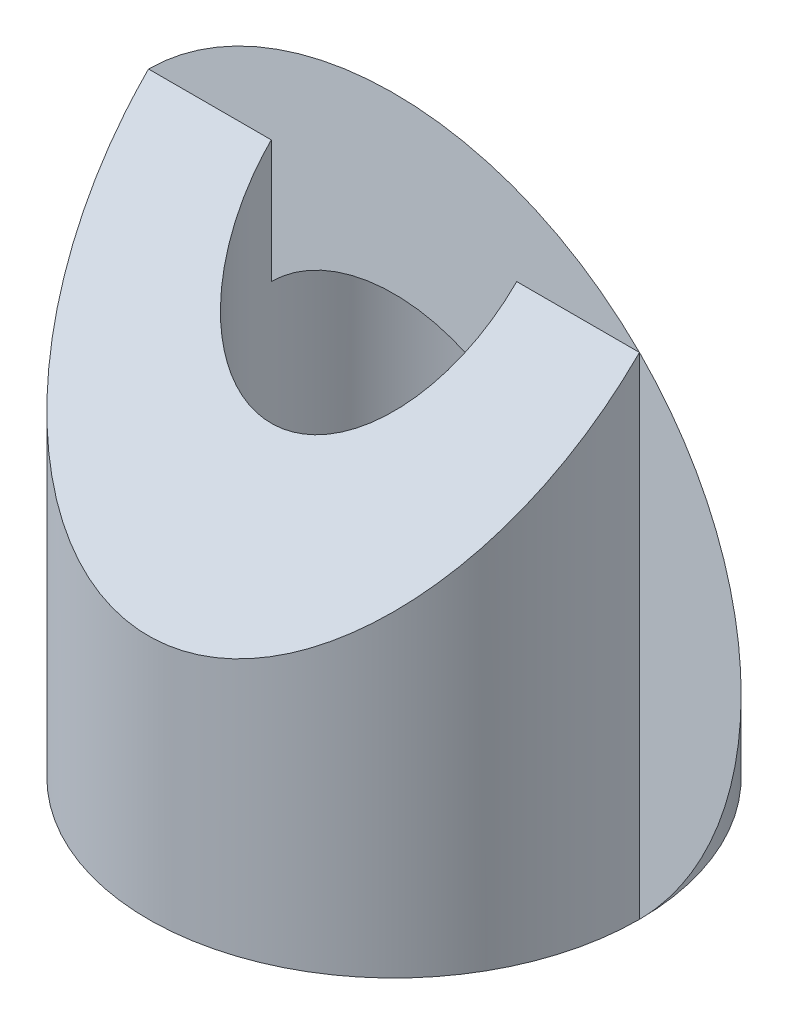
ISO-10303-21;
HEADER;
FILE_DESCRIPTION(('STEP AP214'),'2;1');
FILE_NAME('part.step','',(''),(''),'','','');
FILE_SCHEMA(('AUTOMOTIVE_DESIGN { 1 0 10303 214 1 1 1 1 }'));
ENDSEC;
DATA;
#1=APPLICATION_CONTEXT('core data for automotive mechanical design processes');
#2=APPLICATION_PROTOCOL_DEFINITION('international standard','automotive_design',2000,#1);
#3=PRODUCT_CONTEXT('',#1,'mechanical');
#4=PRODUCT('Part','Part','',(#3));
#5=PRODUCT_RELATED_PRODUCT_CATEGORY('part','',(#4));
#6=PRODUCT_DEFINITION_FORMATION('','',#4);
#7=PRODUCT_DEFINITION_CONTEXT('part definition',#1,'design');
#8=PRODUCT_DEFINITION('design','',#6,#7);
#9=PRODUCT_DEFINITION_SHAPE('','',#8);
#10=(LENGTH_UNIT() NAMED_UNIT(*) SI_UNIT(.MILLI.,.METRE.));
#11=(NAMED_UNIT(*) PLANE_ANGLE_UNIT() SI_UNIT($,.RADIAN.));
#12=(NAMED_UNIT(*) SI_UNIT($,.STERADIAN.) SOLID_ANGLE_UNIT());
#13=UNCERTAINTY_MEASURE_WITH_UNIT(LENGTH_MEASURE(1.E-05),#10,'distance_accuracy_value','');
#14=(GEOMETRIC_REPRESENTATION_CONTEXT(3) GLOBAL_UNCERTAINTY_ASSIGNED_CONTEXT((#13)) GLOBAL_UNIT_ASSIGNED_CONTEXT((#10,
#11,#12)) REPRESENTATION_CONTEXT('',''));
#15=CARTESIAN_POINT('',(0.,0.,0.));
#16=DIRECTION('',(0.,0.,1.));
#17=DIRECTION('',(1.,0.,0.));
#18=AXIS2_PLACEMENT_3D('',#15,#16,#17);
#19=CARTESIAN_POINT('',(0.,0.,0.));
#20=DIRECTION('',(0.,1.,0.));
#21=DIRECTION('',(0.,0.,1.));
#22=AXIS2_PLACEMENT_3D('',#19,#20,#21);
#23=PLANE('',#22);
#24=CARTESIAN_POINT('',(0.,0.,0.));
#25=DIRECTION('',(0.,1.,0.));
#26=DIRECTION('',(0.,0.,1.));
#27=AXIS2_PLACEMENT_3D('',#24,#25,#26);
#28=CIRCLE('',#27,2.);
#29=CARTESIAN_POINT('',(2.,0.,0.));
#30=VERTEX_POINT('',#29);
#31=EDGE_CURVE('E89',#30,#30,#28,.T.);
#32=ORIENTED_EDGE('',*,*,#31,.F.);
#33=EDGE_LOOP('',(#32));
#34=FACE_BOUND('',#33,.T.);
#35=CARTESIAN_POINT('',(0.,0.,0.));
#36=DIRECTION('',(0.,1.,0.));
#37=DIRECTION('',(0.,0.,1.));
#38=AXIS2_PLACEMENT_3D('',#35,#36,#37);
#39=CIRCLE('',#38,1.);
#40=CARTESIAN_POINT('',(0.,0.,1.));
#41=VERTEX_POINT('',#40);
#42=EDGE_CURVE('E93',#41,#41,#39,.T.);
#43=ORIENTED_EDGE('',*,*,#42,.T.);
#44=EDGE_LOOP('',(#43));
#45=FACE_BOUND('',#44,.T.);
#46=ADVANCED_FACE('F33',(#34,#45),#23,.F.);
#47=CARTESIAN_POINT('',(0.,4.,0.));
#48=DIRECTION('',(0.,-1.,0.));
#49=DIRECTION('',(0.,0.,-1.));
#50=AXIS2_PLACEMENT_3D('',#47,#48,#49);
#51=CYLINDRICAL_SURFACE('',#50,2.);
#52=CARTESIAN_POINT('',(0.,4.,0.));
#53=DIRECTION('',(0.,-0.707106781186547,-0.707106781186547));
#54=DIRECTION('',(0.,-0.707106781186548,0.707106781186548));
#55=AXIS2_PLACEMENT_3D('',#52,#53,#54);
#56=ELLIPSE('',#55,2.82842712474619,2.);
#57=CARTESIAN_POINT('',(2.,4.,0.));
#58=VERTEX_POINT('',#57);
#59=CARTESIAN_POINT('',(-2.,4.,0.));
#60=VERTEX_POINT('',#59);
#61=EDGE_CURVE('E86',#58,#60,#56,.T.);
#62=ORIENTED_EDGE('',*,*,#61,.T.);
#63=CARTESIAN_POINT('',(0.,2.,0.));
#64=DIRECTION('',(-0.707106781186548,-0.707106781186548,0.));
#65=DIRECTION('',(0.707106781186548,-0.707106781186548,0.));
#66=AXIS2_PLACEMENT_3D('',#63,#64,#65);
#67=ELLIPSE('',#66,2.82842712474619,2.);
#68=EDGE_CURVE('E81',#60,#30,#67,.T.);
#69=ORIENTED_EDGE('',*,*,#68,.T.);
#70=ORIENTED_EDGE('',*,*,#31,.T.);
#71=DIRECTION('',(0.,1.,0.));
#72=VECTOR('',#71,1.);
#73=CARTESIAN_POINT('',(2.,4.,0.));
#74=LINE('',#73,#72);
#75=EDGE_CURVE('E72',#30,#58,#74,.T.);
#76=ORIENTED_EDGE('',*,*,#75,.T.);
#77=EDGE_LOOP('',(#62,#69,#70,#76));
#78=FACE_BOUND('',#77,.T.);
#79=ADVANCED_FACE('F35',(#78),#51,.T.);
#80=CARTESIAN_POINT('',(0.,4.,0.));
#81=DIRECTION('',(0.,-1.,0.));
#82=DIRECTION('',(0.,0.,-1.));
#83=AXIS2_PLACEMENT_3D('',#80,#81,#82);
#84=CYLINDRICAL_SURFACE('',#83,1.);
#85=DIRECTION('',(0.,-1.,0.));
#86=VECTOR('',#85,1.);
#87=CARTESIAN_POINT('',(-1.,4.,0.));
#88=LINE('',#87,#86);
#89=CARTESIAN_POINT('',(-1.,4.,0.));
#90=VERTEX_POINT('',#89);
#91=CARTESIAN_POINT('',(-1.,3.,0.));
#92=VERTEX_POINT('',#91);
#93=EDGE_CURVE('E103',#90,#92,#88,.T.);
#94=ORIENTED_EDGE('',*,*,#93,.F.);
#95=CARTESIAN_POINT('',(0.,4.,0.));
#96=DIRECTION('',(0.,-0.707106781186547,-0.707106781186547));
#97=DIRECTION('',(0.,-0.707106781186548,0.707106781186548));
#98=AXIS2_PLACEMENT_3D('',#95,#96,#97);
#99=ELLIPSE('',#98,1.4142135623731,1.);
#100=CARTESIAN_POINT('',(1.,4.,0.));
#101=VERTEX_POINT('',#100);
#102=EDGE_CURVE('E41',#101,#90,#99,.T.);
#103=ORIENTED_EDGE('',*,*,#102,.F.);
#104=DIRECTION('',(0.,-1.,0.));
#105=VECTOR('',#104,1.);
#106=CARTESIAN_POINT('',(1.,4.,0.));
#107=LINE('',#106,#105);
#108=CARTESIAN_POINT('',(1.,1.,0.));
#109=VERTEX_POINT('',#108);
#110=EDGE_CURVE('E75',#109,#101,#107,.F.);
#111=ORIENTED_EDGE('',*,*,#110,.F.);
#112=CARTESIAN_POINT('',(0.,2.,0.));
#113=DIRECTION('',(-0.707106781186548,-0.707106781186548,0.));
#114=DIRECTION('',(0.707106781186548,-0.707106781186548,0.));
#115=AXIS2_PLACEMENT_3D('',#112,#113,#114);
#116=ELLIPSE('',#115,1.41421356237309,1.);
#117=EDGE_CURVE('E11',#92,#109,#116,.T.);
#118=ORIENTED_EDGE('',*,*,#117,.F.);
#119=EDGE_LOOP('',(#94,#103,#111,#118));
#120=FACE_BOUND('',#119,.T.);
#121=ORIENTED_EDGE('',*,*,#42,.F.);
#122=EDGE_LOOP('',(#121));
#123=FACE_BOUND('',#122,.T.);
#124=ADVANCED_FACE('F101',(#120,#123),#84,.F.);
#125=CARTESIAN_POINT('',(-2.,2.,2.));
#126=DIRECTION('',(0.,-0.707106781186547,-0.707106781186547));
#127=DIRECTION('',(0.,0.707106781186548,-0.707106781186548));
#128=AXIS2_PLACEMENT_3D('',#125,#126,#127);
#129=PLANE('',#128);
#130=ORIENTED_EDGE('',*,*,#61,.F.);
#131=DIRECTION('',(1.,0.,0.));
#132=VECTOR('',#131,1.);
#133=CARTESIAN_POINT('',(-2.,4.,0.));
#134=LINE('',#133,#132);
#135=EDGE_CURVE('E69',#101,#58,#134,.T.);
#136=ORIENTED_EDGE('',*,*,#135,.F.);
#137=ORIENTED_EDGE('',*,*,#102,.T.);
#138=EDGE_CURVE('E80',#60,#90,#134,.T.);
#139=ORIENTED_EDGE('',*,*,#138,.F.);
#140=EDGE_LOOP('',(#130,#136,#137,#139));
#141=FACE_BOUND('',#140,.T.);
#142=ADVANCED_FACE('F92',(#141),#129,.F.);
#143=CARTESIAN_POINT('',(2.,0.,-10.));
#144=DIRECTION('',(-0.707106781186548,-0.707106781186548,0.));
#145=DIRECTION('',(0.707106781186548,-0.707106781186548,0.));
#146=AXIS2_PLACEMENT_3D('',#143,#144,#145);
#147=PLANE('',#146);
#148=DIRECTION('',(0.707106781186548,-0.707106781186548,0.));
#149=VECTOR('',#148,1.);
#150=CARTESIAN_POINT('',(2.,0.,0.));
#151=LINE('',#150,#149);
#152=EDGE_CURVE('E48',#60,#92,#151,.T.);
#153=ORIENTED_EDGE('',*,*,#152,.T.);
#154=ORIENTED_EDGE('',*,*,#117,.T.);
#155=EDGE_CURVE('E90',#109,#30,#151,.T.);
#156=ORIENTED_EDGE('',*,*,#155,.T.);
#157=ORIENTED_EDGE('',*,*,#68,.F.);
#158=EDGE_LOOP('',(#153,#154,#156,#157));
#159=FACE_BOUND('',#158,.T.);
#160=ADVANCED_FACE('F107',(#159),#147,.F.);
#161=CARTESIAN_POINT('',(0.,0.,0.));
#162=DIRECTION('',(0.,0.,1.));
#163=DIRECTION('',(1.,0.,0.));
#164=AXIS2_PLACEMENT_3D('',#161,#162,#163);
#165=PLANE('',#164);
#166=ORIENTED_EDGE('',*,*,#93,.T.);
#167=ORIENTED_EDGE('',*,*,#152,.F.);
#168=ORIENTED_EDGE('',*,*,#138,.T.);
#169=EDGE_LOOP('',(#166,#167,#168));
#170=FACE_BOUND('',#169,.T.);
#171=ADVANCED_FACE('F109',(#170),#165,.F.);
#172=ORIENTED_EDGE('',*,*,#110,.T.);
#173=ORIENTED_EDGE('',*,*,#135,.T.);
#174=ORIENTED_EDGE('',*,*,#75,.F.);
#175=ORIENTED_EDGE('',*,*,#155,.F.);
#176=EDGE_LOOP('',(#172,#173,#174,#175));
#177=FACE_BOUND('',#176,.T.);
#178=ADVANCED_FACE('F71',(#177),#165,.F.);
#179=CLOSED_SHELL('',(#46,#79,#124,#142,#160,#171,#178));
#180=MANIFOLD_SOLID_BREP('B2',#179);
#181=ADVANCED_BREP_SHAPE_REPRESENTATION('',(#18,#180),#14);
#182=SHAPE_DEFINITION_REPRESENTATION(#9,#181);
ENDSEC;
END-ISO-10303-21;
